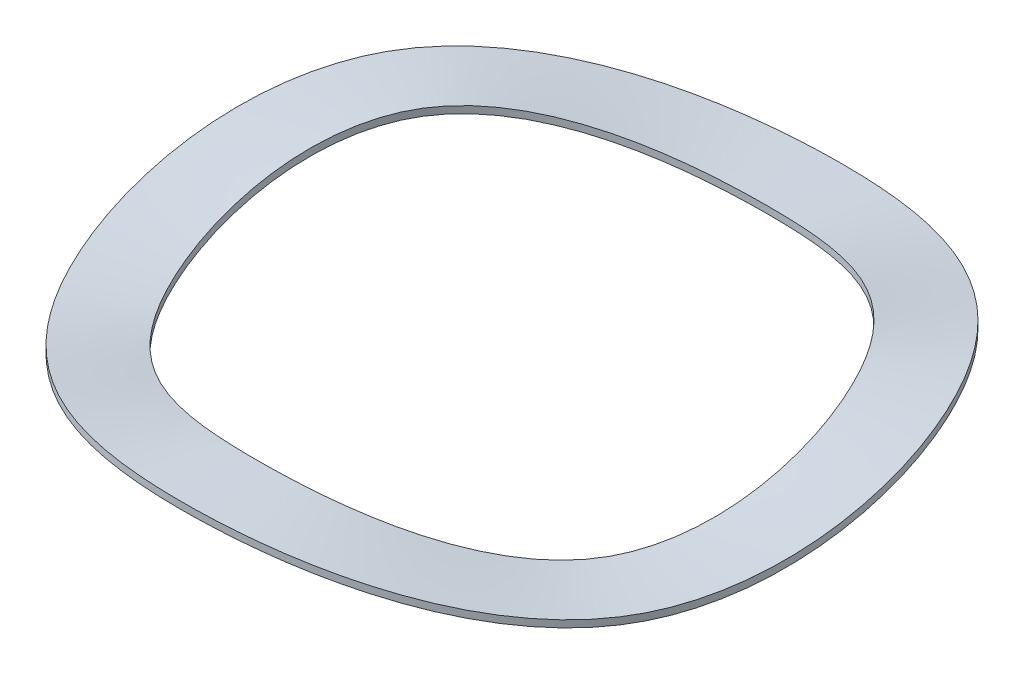
ISO-10303-21;
HEADER;
FILE_DESCRIPTION(('STEP AP214'),'2;1');
FILE_NAME('part.step','',(''),(''),'','','');
FILE_SCHEMA(('AUTOMOTIVE_DESIGN { 1 0 10303 214 1 1 1 1 }'));
ENDSEC;
DATA;
#1=APPLICATION_CONTEXT('core data for automotive mechanical design processes');
#2=APPLICATION_PROTOCOL_DEFINITION('international standard','automotive_design',2000,#1);
#3=PRODUCT_CONTEXT('',#1,'mechanical');
#4=PRODUCT('Part','Part','',(#3));
#5=PRODUCT_RELATED_PRODUCT_CATEGORY('part','',(#4));
#6=PRODUCT_DEFINITION_FORMATION('','',#4);
#7=PRODUCT_DEFINITION_CONTEXT('part definition',#1,'design');
#8=PRODUCT_DEFINITION('design','',#6,#7);
#9=PRODUCT_DEFINITION_SHAPE('','',#8);
#10=(LENGTH_UNIT() NAMED_UNIT(*) SI_UNIT(.MILLI.,.METRE.));
#11=(NAMED_UNIT(*) PLANE_ANGLE_UNIT() SI_UNIT($,.RADIAN.));
#12=(NAMED_UNIT(*) SI_UNIT($,.STERADIAN.) SOLID_ANGLE_UNIT());
#13=UNCERTAINTY_MEASURE_WITH_UNIT(LENGTH_MEASURE(1.E-05),#10,'distance_accuracy_value','');
#14=(GEOMETRIC_REPRESENTATION_CONTEXT(3) GLOBAL_UNCERTAINTY_ASSIGNED_CONTEXT((#13)) GLOBAL_UNIT_ASSIGNED_CONTEXT((#10,
#11,#12)) REPRESENTATION_CONTEXT('',''));
#15=CARTESIAN_POINT('',(0.,0.,0.));
#16=DIRECTION('',(0.,0.,1.));
#17=DIRECTION('',(1.,0.,0.));
#18=AXIS2_PLACEMENT_3D('',#15,#16,#17);
#19=CARTESIAN_POINT('',(0.,0.,-10.6553));
#20=CARTESIAN_POINT('',(3.69110419397773,0.,-10.6553));
#21=CARTESIAN_POINT('',(11.0733125819332,3.1242,-6.39318));
#22=CARTESIAN_POINT('',(11.0733125819332,-1.5621,6.39318000000003));
#23=CARTESIAN_POINT('',(0.,3.12419999999999,12.78636));
#24=CARTESIAN_POINT('',(-11.0733125819332,-1.5621,6.39317999999996));
#25=CARTESIAN_POINT('',(-11.0733125819332,1.5621,-2.13106000000005));
#26=CARTESIAN_POINT('',(-7.38220838795543,1.5621,-8.52424000000004));
#27=CARTESIAN_POINT('',(-3.69110419397772,0.,-10.6553));
#28=CARTESIAN_POINT('',(0.,0.,-10.6553));
#29=CARTESIAN_POINT('',(0.,0.,-11.6755333333333));
#30=CARTESIAN_POINT('',(4.04452338775946,0.,-11.6755333333333));
#31=CARTESIAN_POINT('',(12.1335701632784,3.1242,-7.00532));
#32=CARTESIAN_POINT('',(12.1335701632784,-1.5621,7.00532000000003));
#33=CARTESIAN_POINT('',(0.,3.1242,14.01064));
#34=CARTESIAN_POINT('',(-12.1335701632785,-1.5621,7.00531999999996));
#35=CARTESIAN_POINT('',(-12.1335701632784,1.5621,-2.33510666666672));
#36=CARTESIAN_POINT('',(-8.08904677551891,1.5621,-9.34042666666671));
#37=CARTESIAN_POINT('',(-4.04452338775946,0.,-11.6755333333333));
#38=CARTESIAN_POINT('',(0.,0.,-11.6755333333333));
#39=CARTESIAN_POINT('',(0.,0.,-12.6957666666667));
#40=CARTESIAN_POINT('',(4.3979425815412,0.,-12.6957666666667));
#41=CARTESIAN_POINT('',(13.1938277446236,3.1242,-7.61746));
#42=CARTESIAN_POINT('',(13.1938277446236,-1.5621,7.61746000000003));
#43=CARTESIAN_POINT('',(0.,3.1242,15.23492));
#44=CARTESIAN_POINT('',(-13.1938277446237,-1.5621,7.61745999999995));
#45=CARTESIAN_POINT('',(-13.1938277446236,1.5621,-2.53915333333339));
#46=CARTESIAN_POINT('',(-8.79588516308238,1.5621,-10.1566133333334));
#47=CARTESIAN_POINT('',(-4.3979425815412,0.,-12.6957666666667));
#48=CARTESIAN_POINT('',(0.,0.,-12.6957666666667));
#49=CARTESIAN_POINT('',(0.,0.,-13.716));
#50=CARTESIAN_POINT('',(4.75136177532294,0.,-13.716));
#51=CARTESIAN_POINT('',(14.2540853259689,3.1242,-8.2296));
#52=CARTESIAN_POINT('',(14.2540853259688,-1.5621,8.22960000000003));
#53=CARTESIAN_POINT('',(0.,3.1242,16.4592));
#54=CARTESIAN_POINT('',(-14.2540853259689,-1.5621,8.22959999999994));
#55=CARTESIAN_POINT('',(-14.2540853259688,1.5621,-2.74320000000006));
#56=CARTESIAN_POINT('',(-9.50272355064585,1.5621,-10.9728));
#57=CARTESIAN_POINT('',(-4.75136177532293,0.,-13.716));
#58=CARTESIAN_POINT('',(0.,0.,-13.716));
#59=B_SPLINE_SURFACE_WITH_KNOTS('',3,3,((#19,#20,#21,#22,#23,#24,#25,#26,#27,#28),(#29,#30,#31,
#32,#33,#34,#35,#36,#37,#38),(#39,#40,#41,#42,#43,#44,#45,#46,#47,#48),(#49,#50,#51,#52,#53,#54,
#55,#56,#57,#58)),.UNSPECIFIED.,.F.,.T.,.F.,(4,4),(4,1,1,1,1,2,4),(0.,1.),(0.,0.166666666666667,
0.333333333333334,0.5,0.666666666666666,0.833333333333333,1.),.UNSPECIFIED.);
#60=CARTESIAN_POINT('',(0.,0.,-10.6553));
#61=CARTESIAN_POINT('',(3.69110419397773,0.,-10.6553));
#62=CARTESIAN_POINT('',(11.0733125819332,3.1242,-6.39318));
#63=CARTESIAN_POINT('',(11.0733125819332,-1.5621,6.39318000000003));
#64=CARTESIAN_POINT('',(0.,3.12419999999999,12.78636));
#65=CARTESIAN_POINT('',(-11.0733125819332,-1.5621,6.39317999999996));
#66=CARTESIAN_POINT('',(-11.0733125819332,1.5621,-2.13106000000005));
#67=CARTESIAN_POINT('',(-7.38220838795543,1.5621,-8.52424000000004));
#68=CARTESIAN_POINT('',(-3.69110419397772,0.,-10.6553));
#69=CARTESIAN_POINT('',(0.,0.,-10.6553));
#70=B_SPLINE_CURVE_WITH_KNOTS('',3,(#60,#61,#62,#63,#64,#65,#66,#67,#68,#69),.UNSPECIFIED.,.T.,
.F.,(4,1,1,1,1,2,4),(0.,0.166666666666667,0.333333333333334,0.5,0.666666666666666,
0.833333333333333,1.),.UNSPECIFIED.);
#71=CARTESIAN_POINT('',(0.,0.,-10.6553));
#72=VERTEX_POINT('',#71);
#73=EDGE_CURVE('E32',#72,#72,#70,.T.);
#74=CARTESIAN_POINT('',(0.,0.,-13.716));
#75=CARTESIAN_POINT('',(4.75136177532294,0.,-13.716));
#76=CARTESIAN_POINT('',(14.2540853259689,3.1242,-8.2296));
#77=CARTESIAN_POINT('',(14.2540853259688,-1.5621,8.22960000000003));
#78=CARTESIAN_POINT('',(0.,3.1242,16.4592));
#79=CARTESIAN_POINT('',(-14.2540853259689,-1.5621,8.22959999999994));
#80=CARTESIAN_POINT('',(-14.2540853259688,1.5621,-2.74320000000006));
#81=CARTESIAN_POINT('',(-9.50272355064585,1.5621,-10.9728));
#82=CARTESIAN_POINT('',(-4.75136177532293,0.,-13.716));
#83=CARTESIAN_POINT('',(0.,0.,-13.716));
#84=B_SPLINE_CURVE_WITH_KNOTS('',3,(#74,#75,#76,#77,#78,#79,#80,#81,#82,#83),.UNSPECIFIED.,.T.,
.F.,(4,1,1,1,1,2,4),(0.,0.166666666666667,0.333333333333334,0.5,0.666666666666666,
0.833333333333333,1.),.UNSPECIFIED.);
#85=CARTESIAN_POINT('',(0.,0.,-13.716));
#86=VERTEX_POINT('',#85);
#87=EDGE_CURVE('E21',#86,#86,#84,.F.);
#88=ORIENTED_EDGE('',*,*,#73,.F.);
#89=EDGE_LOOP('',(#88));
#90=FACE_BOUND('',#89,.T.);
#91=ORIENTED_EDGE('',*,*,#87,.F.);
#92=EDGE_LOOP('',(#91));
#93=FACE_BOUND('',#92,.T.);
#94=ADVANCED_FACE('F15',(#90,#93),#59,.T.);
#95=CARTESIAN_POINT('',(0.,0.,-13.716));
#96=CARTESIAN_POINT('',(4.75136177532294,0.,-13.716));
#97=CARTESIAN_POINT('',(14.2540853259689,3.1242,-8.2296));
#98=CARTESIAN_POINT('',(14.2540853259688,-1.5621,8.22960000000003));
#99=CARTESIAN_POINT('',(0.,3.1242,16.4592));
#100=CARTESIAN_POINT('',(-14.2540853259689,-1.5621,8.22959999999994));
#101=CARTESIAN_POINT('',(-14.2540853259688,1.5621,-2.74320000000006));
#102=CARTESIAN_POINT('',(-9.50272355064585,1.5621,-10.9728));
#103=CARTESIAN_POINT('',(-4.75136177532293,0.,-13.716));
#104=CARTESIAN_POINT('',(0.,0.,-13.716));
#105=CARTESIAN_POINT('',(0.,0.0973666666666665,-13.716));
#106=CARTESIAN_POINT('',(4.75136177532294,0.0973666666666662,-13.716));
#107=CARTESIAN_POINT('',(14.2540853259689,3.22156666666667,-8.2296));
#108=CARTESIAN_POINT('',(14.2540853259688,-1.46473333333333,8.22960000000003));
#109=CARTESIAN_POINT('',(0.,3.22156666666666,16.4592));
#110=CARTESIAN_POINT('',(-14.2540853259689,-1.46473333333333,8.22959999999994));
#111=CARTESIAN_POINT('',(-14.2540853259688,1.65946666666666,-2.74320000000006));
#112=CARTESIAN_POINT('',(-9.50272355064585,1.65946666666667,-10.9728));
#113=CARTESIAN_POINT('',(-4.75136177532293,0.0973666666666667,-13.716));
#114=CARTESIAN_POINT('',(0.,0.0973666666666665,-13.716));
#115=CARTESIAN_POINT('',(0.,0.194733333333333,-13.716));
#116=CARTESIAN_POINT('',(4.75136177532294,0.194733333333333,-13.716));
#117=CARTESIAN_POINT('',(14.2540853259689,3.31893333333333,-8.2296));
#118=CARTESIAN_POINT('',(14.2540853259688,-1.36736666666666,8.22960000000003));
#119=CARTESIAN_POINT('',(0.,3.31893333333333,16.4592));
#120=CARTESIAN_POINT('',(-14.2540853259689,-1.36736666666667,8.22959999999994));
#121=CARTESIAN_POINT('',(-14.2540853259688,1.75683333333333,-2.74320000000006));
#122=CARTESIAN_POINT('',(-9.50272355064585,1.75683333333334,-10.9728));
#123=CARTESIAN_POINT('',(-4.75136177532293,0.194733333333333,-13.716));
#124=CARTESIAN_POINT('',(0.,0.194733333333333,-13.716));
#125=CARTESIAN_POINT('',(0.,0.292099999999999,-13.716));
#126=CARTESIAN_POINT('',(4.75136177532294,0.292099999999999,-13.716));
#127=CARTESIAN_POINT('',(14.2540853259689,3.4163,-8.2296));
#128=CARTESIAN_POINT('',(14.2540853259688,-1.27,8.22960000000003));
#129=CARTESIAN_POINT('',(0.,3.41629999999999,16.4592));
#130=CARTESIAN_POINT('',(-14.2540853259689,-1.27,8.22959999999994));
#131=CARTESIAN_POINT('',(-14.2540853259688,1.8542,-2.74320000000006));
#132=CARTESIAN_POINT('',(-9.50272355064585,1.8542,-10.9728));
#133=CARTESIAN_POINT('',(-4.75136177532293,0.2921,-13.716));
#134=CARTESIAN_POINT('',(0.,0.292099999999999,-13.716));
#135=B_SPLINE_SURFACE_WITH_KNOTS('',3,3,((#95,#96,#97,#98,#99,#100,#101,#102,#103,#104),(#105,
#106,#107,#108,#109,#110,#111,#112,#113,#114),(#115,#116,#117,#118,#119,#120,#121,#122,#123,
#124),(#125,#126,#127,#128,#129,#130,#131,#132,#133,#134)),.UNSPECIFIED.,.F.,.T.,.F.,(4,4),(4,1,
1,1,1,2,4),(0.,1.),(0.,0.166666666666667,0.333333333333334,0.5,0.666666666666666,
0.833333333333333,1.),.UNSPECIFIED.);
#136=CARTESIAN_POINT('',(0.,0.292099999999999,-13.716));
#137=CARTESIAN_POINT('',(4.75136177532294,0.292099999999999,-13.716));
#138=CARTESIAN_POINT('',(14.2540853259689,3.4163,-8.2296));
#139=CARTESIAN_POINT('',(14.2540853259688,-1.27,8.22960000000003));
#140=CARTESIAN_POINT('',(0.,3.41629999999999,16.4592));
#141=CARTESIAN_POINT('',(-14.2540853259689,-1.27,8.22959999999994));
#142=CARTESIAN_POINT('',(-14.2540853259688,1.8542,-2.74320000000006));
#143=CARTESIAN_POINT('',(-9.50272355064585,1.8542,-10.9728));
#144=CARTESIAN_POINT('',(-4.75136177532293,0.2921,-13.716));
#145=CARTESIAN_POINT('',(0.,0.292099999999999,-13.716));
#146=B_SPLINE_CURVE_WITH_KNOTS('',3,(#136,#137,#138,#139,#140,#141,#142,#143,#144,#145),
.UNSPECIFIED.,.T.,.F.,(4,1,1,1,1,2,4),(0.,0.166666666666667,0.333333333333334,0.5,
0.666666666666666,0.833333333333333,1.),.UNSPECIFIED.);
#147=CARTESIAN_POINT('',(0.,0.292099999999999,-13.716));
#148=VERTEX_POINT('',#147);
#149=EDGE_CURVE('E27',#148,#148,#146,.F.);
#150=ORIENTED_EDGE('',*,*,#87,.T.);
#151=EDGE_LOOP('',(#150));
#152=FACE_BOUND('',#151,.T.);
#153=ORIENTED_EDGE('',*,*,#149,.F.);
#154=EDGE_LOOP('',(#153));
#155=FACE_BOUND('',#154,.T.);
#156=ADVANCED_FACE('F55',(#152,#155),#135,.T.);
#157=CARTESIAN_POINT('',(0.,0.292099999999999,-10.6553));
#158=CARTESIAN_POINT('',(3.69110419397773,0.292099999999999,-10.6553));
#159=CARTESIAN_POINT('',(11.0733125819332,3.4163,-6.39318));
#160=CARTESIAN_POINT('',(11.0733125819332,-1.27,6.39318000000003));
#161=CARTESIAN_POINT('',(0.,3.4163,12.78636));
#162=CARTESIAN_POINT('',(-11.0733125819332,-1.27000000000001,6.39317999999996));
#163=CARTESIAN_POINT('',(-11.0733125819332,1.8542,-2.13106000000005));
#164=CARTESIAN_POINT('',(-7.38220838795543,1.8542,-8.52424000000004));
#165=CARTESIAN_POINT('',(-3.69110419397772,0.2921,-10.6553));
#166=CARTESIAN_POINT('',(0.,0.292099999999999,-10.6553));
#167=CARTESIAN_POINT('',(0.,0.194733333333333,-10.6553));
#168=CARTESIAN_POINT('',(3.69110419397773,0.194733333333332,-10.6553));
#169=CARTESIAN_POINT('',(11.0733125819332,3.31893333333334,-6.39318));
#170=CARTESIAN_POINT('',(11.0733125819332,-1.36736666666667,6.39318000000003));
#171=CARTESIAN_POINT('',(0.,3.31893333333333,12.78636));
#172=CARTESIAN_POINT('',(-11.0733125819332,-1.36736666666667,6.39317999999996));
#173=CARTESIAN_POINT('',(-11.0733125819332,1.75683333333333,-2.13106000000005));
#174=CARTESIAN_POINT('',(-7.38220838795543,1.75683333333334,-8.52424000000004));
#175=CARTESIAN_POINT('',(-3.69110419397772,0.194733333333333,-10.6553));
#176=CARTESIAN_POINT('',(0.,0.194733333333333,-10.6553));
#177=CARTESIAN_POINT('',(0.,0.0973666666666658,-10.6553));
#178=CARTESIAN_POINT('',(3.69110419397773,0.0973666666666655,-10.6553));
#179=CARTESIAN_POINT('',(11.0733125819332,3.22156666666667,-6.39318));
#180=CARTESIAN_POINT('',(11.0733125819332,-1.46473333333333,6.39318000000003));
#181=CARTESIAN_POINT('',(0.,3.22156666666666,12.78636));
#182=CARTESIAN_POINT('',(-11.0733125819332,-1.46473333333333,6.39317999999996));
#183=CARTESIAN_POINT('',(-11.0733125819332,1.65946666666666,-2.13106000000005));
#184=CARTESIAN_POINT('',(-7.38220838795543,1.65946666666667,-8.52424000000004));
#185=CARTESIAN_POINT('',(-3.69110419397772,0.0973666666666661,-10.6553));
#186=CARTESIAN_POINT('',(0.,0.0973666666666658,-10.6553));
#187=CARTESIAN_POINT('',(0.,0.,-10.6553));
#188=CARTESIAN_POINT('',(3.69110419397773,0.,-10.6553));
#189=CARTESIAN_POINT('',(11.0733125819332,3.1242,-6.39318));
#190=CARTESIAN_POINT('',(11.0733125819332,-1.5621,6.39318000000003));
#191=CARTESIAN_POINT('',(0.,3.12419999999999,12.78636));
#192=CARTESIAN_POINT('',(-11.0733125819332,-1.5621,6.39317999999996));
#193=CARTESIAN_POINT('',(-11.0733125819332,1.5621,-2.13106000000005));
#194=CARTESIAN_POINT('',(-7.38220838795543,1.5621,-8.52424000000004));
#195=CARTESIAN_POINT('',(-3.69110419397772,0.,-10.6553));
#196=CARTESIAN_POINT('',(0.,0.,-10.6553));
#197=B_SPLINE_SURFACE_WITH_KNOTS('',3,3,((#157,#158,#159,#160,#161,#162,#163,#164,#165,#166),
(#167,#168,#169,#170,#171,#172,#173,#174,#175,#176),(#177,#178,#179,#180,#181,#182,#183,#184,
#185,#186),(#187,#188,#189,#190,#191,#192,#193,#194,#195,#196)),.UNSPECIFIED.,.F.,.T.,.F.,(4,4),
(4,1,1,1,1,2,4),(0.,1.),(0.,0.166666666666667,0.333333333333334,0.5,0.666666666666666,
0.833333333333333,1.),.UNSPECIFIED.);
#198=CARTESIAN_POINT('',(0.,0.292099999999999,-10.6553));
#199=CARTESIAN_POINT('',(3.69110419397773,0.292099999999999,-10.6553));
#200=CARTESIAN_POINT('',(11.0733125819332,3.4163,-6.39318));
#201=CARTESIAN_POINT('',(11.0733125819332,-1.27,6.39318000000003));
#202=CARTESIAN_POINT('',(0.,3.4163,12.78636));
#203=CARTESIAN_POINT('',(-11.0733125819332,-1.27000000000001,6.39317999999997));
#204=CARTESIAN_POINT('',(-11.0733125819332,1.8542,-2.13106000000005));
#205=CARTESIAN_POINT('',(-7.38220838795543,1.8542,-8.52424000000004));
#206=CARTESIAN_POINT('',(-3.69110419397772,0.2921,-10.6553));
#207=CARTESIAN_POINT('',(0.,0.292099999999999,-10.6553));
#208=B_SPLINE_CURVE_WITH_KNOTS('',3,(#198,#199,#200,#201,#202,#203,#204,#205,#206,#207),
.UNSPECIFIED.,.T.,.F.,(4,1,1,1,1,2,4),(0.,0.166666666666667,0.333333333333334,0.5,
0.666666666666666,0.833333333333333,1.),.UNSPECIFIED.);
#209=CARTESIAN_POINT('',(0.,0.292099999999999,-10.6553));
#210=VERTEX_POINT('',#209);
#211=EDGE_CURVE('E10',#210,#210,#208,.T.);
#212=ORIENTED_EDGE('',*,*,#73,.T.);
#213=EDGE_LOOP('',(#212));
#214=FACE_BOUND('',#213,.T.);
#215=ORIENTED_EDGE('',*,*,#211,.F.);
#216=EDGE_LOOP('',(#215));
#217=FACE_BOUND('',#216,.T.);
#218=ADVANCED_FACE('F65',(#214,#217),#197,.T.);
#219=CARTESIAN_POINT('',(0.,0.292099999999999,-13.716));
#220=CARTESIAN_POINT('',(4.75136177532294,0.292099999999999,-13.716));
#221=CARTESIAN_POINT('',(14.2540853259689,3.4163,-8.2296));
#222=CARTESIAN_POINT('',(14.2540853259688,-1.27,8.22960000000003));
#223=CARTESIAN_POINT('',(0.,3.41629999999999,16.4592));
#224=CARTESIAN_POINT('',(-14.2540853259689,-1.27,8.22959999999994));
#225=CARTESIAN_POINT('',(-14.2540853259688,1.8542,-2.74320000000006));
#226=CARTESIAN_POINT('',(-9.50272355064585,1.8542,-10.9728));
#227=CARTESIAN_POINT('',(-4.75136177532293,0.2921,-13.716));
#228=CARTESIAN_POINT('',(0.,0.292099999999999,-13.716));
#229=CARTESIAN_POINT('',(0.,0.292099999999999,-12.6957666666667));
#230=CARTESIAN_POINT('',(4.3979425815412,0.292099999999999,-12.6957666666667));
#231=CARTESIAN_POINT('',(13.1938277446236,3.4163,-7.61746));
#232=CARTESIAN_POINT('',(13.1938277446236,-1.27,7.61746000000003));
#233=CARTESIAN_POINT('',(0.,3.4163,15.23492));
#234=CARTESIAN_POINT('',(-13.1938277446237,-1.27,7.61745999999995));
#235=CARTESIAN_POINT('',(-13.1938277446236,1.8542,-2.53915333333339));
#236=CARTESIAN_POINT('',(-8.79588516308238,1.8542,-10.1566133333334));
#237=CARTESIAN_POINT('',(-4.3979425815412,0.2921,-12.6957666666667));
#238=CARTESIAN_POINT('',(0.,0.292099999999999,-12.6957666666667));
#239=CARTESIAN_POINT('',(0.,0.292099999999999,-11.6755333333333));
#240=CARTESIAN_POINT('',(4.04452338775947,0.292099999999998,-11.6755333333333));
#241=CARTESIAN_POINT('',(12.1335701632784,3.4163,-7.00532));
#242=CARTESIAN_POINT('',(12.1335701632784,-1.27,7.00532000000003));
#243=CARTESIAN_POINT('',(0.,3.4163,14.01064));
#244=CARTESIAN_POINT('',(-12.1335701632785,-1.27000000000001,7.00531999999996));
#245=CARTESIAN_POINT('',(-12.1335701632784,1.8542,-2.33510666666672));
#246=CARTESIAN_POINT('',(-8.08904677551891,1.8542,-9.34042666666671));
#247=CARTESIAN_POINT('',(-4.04452338775946,0.2921,-11.6755333333333));
#248=CARTESIAN_POINT('',(0.,0.292099999999999,-11.6755333333333));
#249=CARTESIAN_POINT('',(0.,0.292099999999999,-10.6553));
#250=CARTESIAN_POINT('',(3.69110419397773,0.292099999999999,-10.6553));
#251=CARTESIAN_POINT('',(11.0733125819332,3.4163,-6.39318));
#252=CARTESIAN_POINT('',(11.0733125819332,-1.27,6.39318000000003));
#253=CARTESIAN_POINT('',(0.,3.4163,12.78636));
#254=CARTESIAN_POINT('',(-11.0733125819332,-1.27000000000001,6.39317999999997));
#255=CARTESIAN_POINT('',(-11.0733125819332,1.8542,-2.13106000000005));
#256=CARTESIAN_POINT('',(-7.38220838795543,1.8542,-8.52424000000004));
#257=CARTESIAN_POINT('',(-3.69110419397772,0.2921,-10.6553));
#258=CARTESIAN_POINT('',(0.,0.292099999999999,-10.6553));
#259=B_SPLINE_SURFACE_WITH_KNOTS('',3,3,((#219,#220,#221,#222,#223,#224,#225,#226,#227,#228),
(#229,#230,#231,#232,#233,#234,#235,#236,#237,#238),(#239,#240,#241,#242,#243,#244,#245,#246,
#247,#248),(#249,#250,#251,#252,#253,#254,#255,#256,#257,#258)),.UNSPECIFIED.,.F.,.T.,.F.,(4,4),
(4,1,1,1,1,2,4),(0.,1.),(0.,0.166666666666667,0.333333333333334,0.5,0.666666666666666,
0.833333333333333,1.),.UNSPECIFIED.);
#260=ORIENTED_EDGE('',*,*,#149,.T.);
#261=EDGE_LOOP('',(#260));
#262=FACE_BOUND('',#261,.T.);
#263=ORIENTED_EDGE('',*,*,#211,.T.);
#264=EDGE_LOOP('',(#263));
#265=FACE_BOUND('',#264,.T.);
#266=ADVANCED_FACE('F17',(#262,#265),#259,.T.);
#267=CLOSED_SHELL('',(#94,#156,#218,#266));
#268=MANIFOLD_SOLID_BREP('B1',#267);
#269=ADVANCED_BREP_SHAPE_REPRESENTATION('',(#18,#268),#14);
#270=SHAPE_DEFINITION_REPRESENTATION(#9,#269);
ENDSEC;
END-ISO-10303-21;
